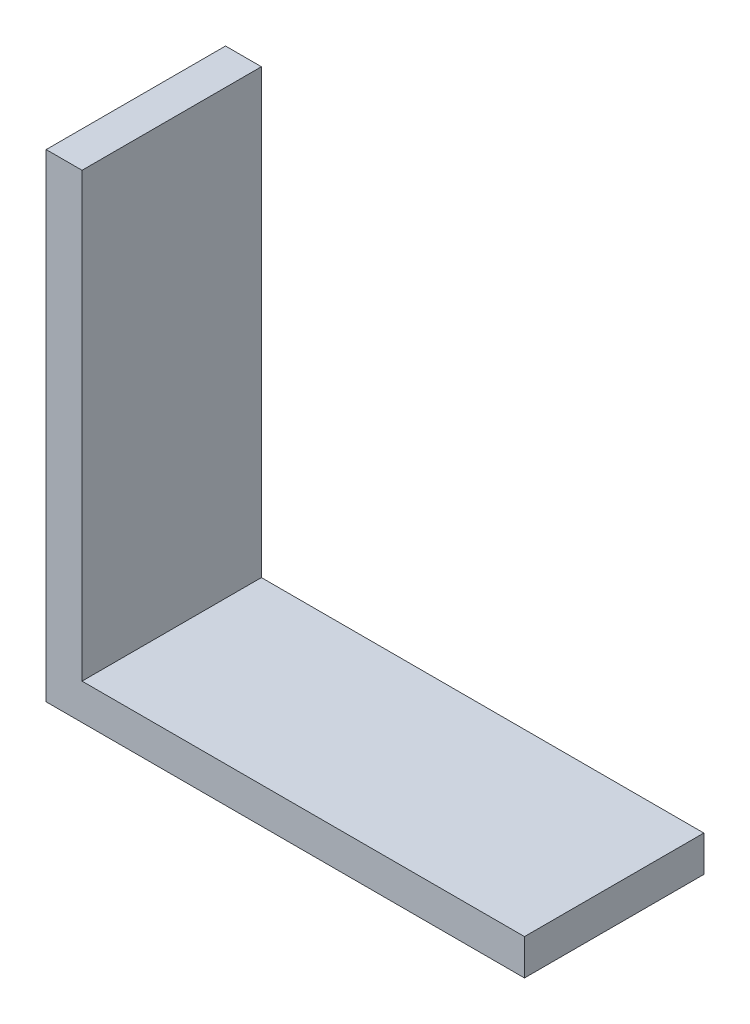
ISO-10303-21;
HEADER;
FILE_DESCRIPTION(('STEP AP214'),'2;1');
FILE_NAME('part.step','',(''),(''),'','','');
FILE_SCHEMA(('AUTOMOTIVE_DESIGN { 1 0 10303 214 1 1 1 1 }'));
ENDSEC;
DATA;
#1=APPLICATION_CONTEXT('core data for automotive mechanical design processes');
#2=APPLICATION_PROTOCOL_DEFINITION('international standard','automotive_design',2000,#1);
#3=PRODUCT_CONTEXT('',#1,'mechanical');
#4=PRODUCT('Part','Part','',(#3));
#5=PRODUCT_RELATED_PRODUCT_CATEGORY('part','',(#4));
#6=PRODUCT_DEFINITION_FORMATION('','',#4);
#7=PRODUCT_DEFINITION_CONTEXT('part definition',#1,'design');
#8=PRODUCT_DEFINITION('design','',#6,#7);
#9=PRODUCT_DEFINITION_SHAPE('','',#8);
#10=(LENGTH_UNIT() NAMED_UNIT(*) SI_UNIT(.MILLI.,.METRE.));
#11=(NAMED_UNIT(*) PLANE_ANGLE_UNIT() SI_UNIT($,.RADIAN.));
#12=(NAMED_UNIT(*) SI_UNIT($,.STERADIAN.) SOLID_ANGLE_UNIT());
#13=UNCERTAINTY_MEASURE_WITH_UNIT(LENGTH_MEASURE(1.E-05),#10,'distance_accuracy_value','');
#14=(GEOMETRIC_REPRESENTATION_CONTEXT(3) GLOBAL_UNCERTAINTY_ASSIGNED_CONTEXT((#13)) GLOBAL_UNIT_ASSIGNED_CONTEXT((#10,
#11,#12)) REPRESENTATION_CONTEXT('',''));
#15=CARTESIAN_POINT('',(0.,0.,0.));
#16=DIRECTION('',(0.,0.,1.));
#17=DIRECTION('',(1.,0.,0.));
#18=AXIS2_PLACEMENT_3D('',#15,#16,#17);
#19=CARTESIAN_POINT('',(0.,3.,0.));
#20=DIRECTION('',(0.,-1.,0.));
#21=DIRECTION('',(0.,0.,-1.));
#22=AXIS2_PLACEMENT_3D('',#19,#20,#21);
#23=PLANE('',#22);
#24=DIRECTION('',(0.,0.,-1.));
#25=VECTOR('',#24,1.);
#26=CARTESIAN_POINT('',(3.,3.,0.));
#27=LINE('',#26,#25);
#28=CARTESIAN_POINT('',(3.,3.,0.));
#29=VERTEX_POINT('',#28);
#30=CARTESIAN_POINT('',(3.,3.,-15.));
#31=VERTEX_POINT('',#30);
#32=EDGE_CURVE('E53',#29,#31,#27,.T.);
#33=ORIENTED_EDGE('',*,*,#32,.F.);
#34=DIRECTION('',(1.,0.,0.));
#35=VECTOR('',#34,1.);
#36=CARTESIAN_POINT('',(0.,3.,0.));
#37=LINE('',#36,#35);
#38=CARTESIAN_POINT('',(40.,3.,0.));
#39=VERTEX_POINT('',#38);
#40=EDGE_CURVE('E90',#29,#39,#37,.T.);
#41=ORIENTED_EDGE('',*,*,#40,.T.);
#42=DIRECTION('',(0.,0.,-1.));
#43=VECTOR('',#42,1.);
#44=CARTESIAN_POINT('',(40.,3.,0.));
#45=LINE('',#44,#43);
#46=CARTESIAN_POINT('',(40.,3.,-15.));
#47=VERTEX_POINT('',#46);
#48=EDGE_CURVE('E59',#39,#47,#45,.T.);
#49=ORIENTED_EDGE('',*,*,#48,.T.);
#50=DIRECTION('',(-1.,0.,0.));
#51=VECTOR('',#50,1.);
#52=CARTESIAN_POINT('',(0.,3.,-15.));
#53=LINE('',#52,#51);
#54=EDGE_CURVE('E100',#47,#31,#53,.T.);
#55=ORIENTED_EDGE('',*,*,#54,.T.);
#56=EDGE_LOOP('',(#33,#41,#49,#55));
#57=FACE_BOUND('',#56,.T.);
#58=ADVANCED_FACE('F38',(#57),#23,.F.);
#59=CARTESIAN_POINT('',(0.,3.,0.));
#60=DIRECTION('',(1.,0.,0.));
#61=DIRECTION('',(0.,0.,-1.));
#62=AXIS2_PLACEMENT_3D('',#59,#60,#61);
#63=PLANE('',#62);
#64=DIRECTION('',(0.,0.,1.));
#65=VECTOR('',#64,1.);
#66=CARTESIAN_POINT('',(0.,0.,0.));
#67=LINE('',#66,#65);
#68=CARTESIAN_POINT('',(0.,0.,-15.));
#69=VERTEX_POINT('',#68);
#70=CARTESIAN_POINT('',(0.,0.,0.));
#71=VERTEX_POINT('',#70);
#72=EDGE_CURVE('E97',#69,#71,#67,.T.);
#73=ORIENTED_EDGE('',*,*,#72,.T.);
#74=DIRECTION('',(0.,-1.,0.));
#75=VECTOR('',#74,1.);
#76=CARTESIAN_POINT('',(0.,3.,0.));
#77=LINE('',#76,#75);
#78=CARTESIAN_POINT('',(0.,40.,0.));
#79=VERTEX_POINT('',#78);
#80=EDGE_CURVE('E11',#79,#71,#77,.T.);
#81=ORIENTED_EDGE('',*,*,#80,.F.);
#82=DIRECTION('',(0.,0.,1.));
#83=VECTOR('',#82,1.);
#84=CARTESIAN_POINT('',(0.,40.,0.));
#85=LINE('',#84,#83);
#86=CARTESIAN_POINT('',(0.,40.,-15.));
#87=VERTEX_POINT('',#86);
#88=EDGE_CURVE('E99',#87,#79,#85,.T.);
#89=ORIENTED_EDGE('',*,*,#88,.F.);
#90=DIRECTION('',(0.,-1.,0.));
#91=VECTOR('',#90,1.);
#92=CARTESIAN_POINT('',(0.,3.,-15.));
#93=LINE('',#92,#91);
#94=EDGE_CURVE('E83',#87,#69,#93,.T.);
#95=ORIENTED_EDGE('',*,*,#94,.T.);
#96=EDGE_LOOP('',(#73,#81,#89,#95));
#97=FACE_BOUND('',#96,.T.);
#98=ADVANCED_FACE('F40',(#97),#63,.F.);
#99=CARTESIAN_POINT('',(0.,3.,0.));
#100=DIRECTION('',(0.,0.,-1.));
#101=DIRECTION('',(-1.,0.,0.));
#102=AXIS2_PLACEMENT_3D('',#99,#100,#101);
#103=PLANE('',#102);
#104=DIRECTION('',(1.,0.,0.));
#105=VECTOR('',#104,1.);
#106=CARTESIAN_POINT('',(0.,0.,0.));
#107=LINE('',#106,#105);
#108=CARTESIAN_POINT('',(40.,0.,0.));
#109=VERTEX_POINT('',#108);
#110=EDGE_CURVE('E103',#71,#109,#107,.T.);
#111=ORIENTED_EDGE('',*,*,#110,.T.);
#112=DIRECTION('',(0.,-1.,0.));
#113=VECTOR('',#112,1.);
#114=CARTESIAN_POINT('',(40.,3.,0.));
#115=LINE('',#114,#113);
#116=EDGE_CURVE('E46',#39,#109,#115,.T.);
#117=ORIENTED_EDGE('',*,*,#116,.F.);
#118=ORIENTED_EDGE('',*,*,#40,.F.);
#119=DIRECTION('',(0.,-1.,0.));
#120=VECTOR('',#119,1.);
#121=CARTESIAN_POINT('',(3.,40.,0.));
#122=LINE('',#121,#120);
#123=CARTESIAN_POINT('',(3.,40.,0.));
#124=VERTEX_POINT('',#123);
#125=EDGE_CURVE('E104',#124,#29,#122,.T.);
#126=ORIENTED_EDGE('',*,*,#125,.F.);
#127=DIRECTION('',(1.,0.,0.));
#128=VECTOR('',#127,1.);
#129=CARTESIAN_POINT('',(0.,40.,0.));
#130=LINE('',#129,#128);
#131=EDGE_CURVE('E124',#79,#124,#130,.T.);
#132=ORIENTED_EDGE('',*,*,#131,.F.);
#133=ORIENTED_EDGE('',*,*,#80,.T.);
#134=EDGE_LOOP('',(#111,#117,#118,#126,#132,#133));
#135=FACE_BOUND('',#134,.T.);
#136=ADVANCED_FACE('F119',(#135),#103,.F.);
#137=CARTESIAN_POINT('',(40.,3.,0.));
#138=DIRECTION('',(-1.,0.,0.));
#139=DIRECTION('',(0.,0.,1.));
#140=AXIS2_PLACEMENT_3D('',#137,#138,#139);
#141=PLANE('',#140);
#142=DIRECTION('',(0.,0.,-1.));
#143=VECTOR('',#142,1.);
#144=CARTESIAN_POINT('',(40.,0.,0.));
#145=LINE('',#144,#143);
#146=CARTESIAN_POINT('',(40.,0.,-15.));
#147=VERTEX_POINT('',#146);
#148=EDGE_CURVE('E91',#109,#147,#145,.T.);
#149=ORIENTED_EDGE('',*,*,#148,.T.);
#150=DIRECTION('',(0.,-1.,0.));
#151=VECTOR('',#150,1.);
#152=CARTESIAN_POINT('',(40.,3.,-15.));
#153=LINE('',#152,#151);
#154=EDGE_CURVE('E86',#47,#147,#153,.T.);
#155=ORIENTED_EDGE('',*,*,#154,.F.);
#156=ORIENTED_EDGE('',*,*,#48,.F.);
#157=ORIENTED_EDGE('',*,*,#116,.T.);
#158=EDGE_LOOP('',(#149,#155,#156,#157));
#159=FACE_BOUND('',#158,.T.);
#160=ADVANCED_FACE('F117',(#159),#141,.F.);
#161=CARTESIAN_POINT('',(0.,3.,-15.));
#162=DIRECTION('',(0.,0.,1.));
#163=DIRECTION('',(1.,0.,0.));
#164=AXIS2_PLACEMENT_3D('',#161,#162,#163);
#165=PLANE('',#164);
#166=DIRECTION('',(-1.,0.,0.));
#167=VECTOR('',#166,1.);
#168=CARTESIAN_POINT('',(0.,0.,-15.));
#169=LINE('',#168,#167);
#170=EDGE_CURVE('E79',#147,#69,#169,.T.);
#171=ORIENTED_EDGE('',*,*,#170,.T.);
#172=ORIENTED_EDGE('',*,*,#94,.F.);
#173=DIRECTION('',(-1.,0.,0.));
#174=VECTOR('',#173,1.);
#175=CARTESIAN_POINT('',(0.,40.,-15.));
#176=LINE('',#175,#174);
#177=CARTESIAN_POINT('',(3.,40.,-15.));
#178=VERTEX_POINT('',#177);
#179=EDGE_CURVE('E138',#178,#87,#176,.T.);
#180=ORIENTED_EDGE('',*,*,#179,.F.);
#181=DIRECTION('',(0.,-1.,0.));
#182=VECTOR('',#181,1.);
#183=CARTESIAN_POINT('',(3.,40.,-15.));
#184=LINE('',#183,#182);
#185=EDGE_CURVE('E108',#178,#31,#184,.T.);
#186=ORIENTED_EDGE('',*,*,#185,.T.);
#187=ORIENTED_EDGE('',*,*,#54,.F.);
#188=ORIENTED_EDGE('',*,*,#154,.T.);
#189=EDGE_LOOP('',(#171,#172,#180,#186,#187,#188));
#190=FACE_BOUND('',#189,.T.);
#191=ADVANCED_FACE('F81',(#190),#165,.F.);
#192=CARTESIAN_POINT('',(0.,0.,0.));
#193=DIRECTION('',(0.,-1.,0.));
#194=DIRECTION('',(0.,0.,-1.));
#195=AXIS2_PLACEMENT_3D('',#192,#193,#194);
#196=PLANE('',#195);
#197=ORIENTED_EDGE('',*,*,#72,.F.);
#198=ORIENTED_EDGE('',*,*,#170,.F.);
#199=ORIENTED_EDGE('',*,*,#148,.F.);
#200=ORIENTED_EDGE('',*,*,#110,.F.);
#201=EDGE_LOOP('',(#197,#198,#199,#200));
#202=FACE_BOUND('',#201,.T.);
#203=ADVANCED_FACE('F102',(#202),#196,.T.);
#204=CARTESIAN_POINT('',(3.,40.,0.));
#205=DIRECTION('',(-1.,0.,0.));
#206=DIRECTION('',(0.,0.,1.));
#207=AXIS2_PLACEMENT_3D('',#204,#205,#206);
#208=PLANE('',#207);
#209=ORIENTED_EDGE('',*,*,#32,.T.);
#210=ORIENTED_EDGE('',*,*,#185,.F.);
#211=DIRECTION('',(0.,0.,-1.));
#212=VECTOR('',#211,1.);
#213=CARTESIAN_POINT('',(3.,40.,0.));
#214=LINE('',#213,#212);
#215=EDGE_CURVE('E135',#124,#178,#214,.T.);
#216=ORIENTED_EDGE('',*,*,#215,.F.);
#217=ORIENTED_EDGE('',*,*,#125,.T.);
#218=EDGE_LOOP('',(#209,#210,#216,#217));
#219=FACE_BOUND('',#218,.T.);
#220=ADVANCED_FACE('F142',(#219),#208,.F.);
#221=CARTESIAN_POINT('',(0.,40.,0.));
#222=DIRECTION('',(0.,-1.,0.));
#223=DIRECTION('',(0.,0.,-1.));
#224=AXIS2_PLACEMENT_3D('',#221,#222,#223);
#225=PLANE('',#224);
#226=ORIENTED_EDGE('',*,*,#88,.T.);
#227=ORIENTED_EDGE('',*,*,#131,.T.);
#228=ORIENTED_EDGE('',*,*,#215,.T.);
#229=ORIENTED_EDGE('',*,*,#179,.T.);
#230=EDGE_LOOP('',(#226,#227,#228,#229));
#231=FACE_BOUND('',#230,.T.);
#232=ADVANCED_FACE('F137',(#231),#225,.F.);
#233=CLOSED_SHELL('',(#58,#98,#136,#160,#191,#203,#220,#232));
#234=MANIFOLD_SOLID_BREP('B2',#233);
#235=ADVANCED_BREP_SHAPE_REPRESENTATION('',(#18,#234),#14);
#236=SHAPE_DEFINITION_REPRESENTATION(#9,#235);
ENDSEC;
END-ISO-10303-21;
